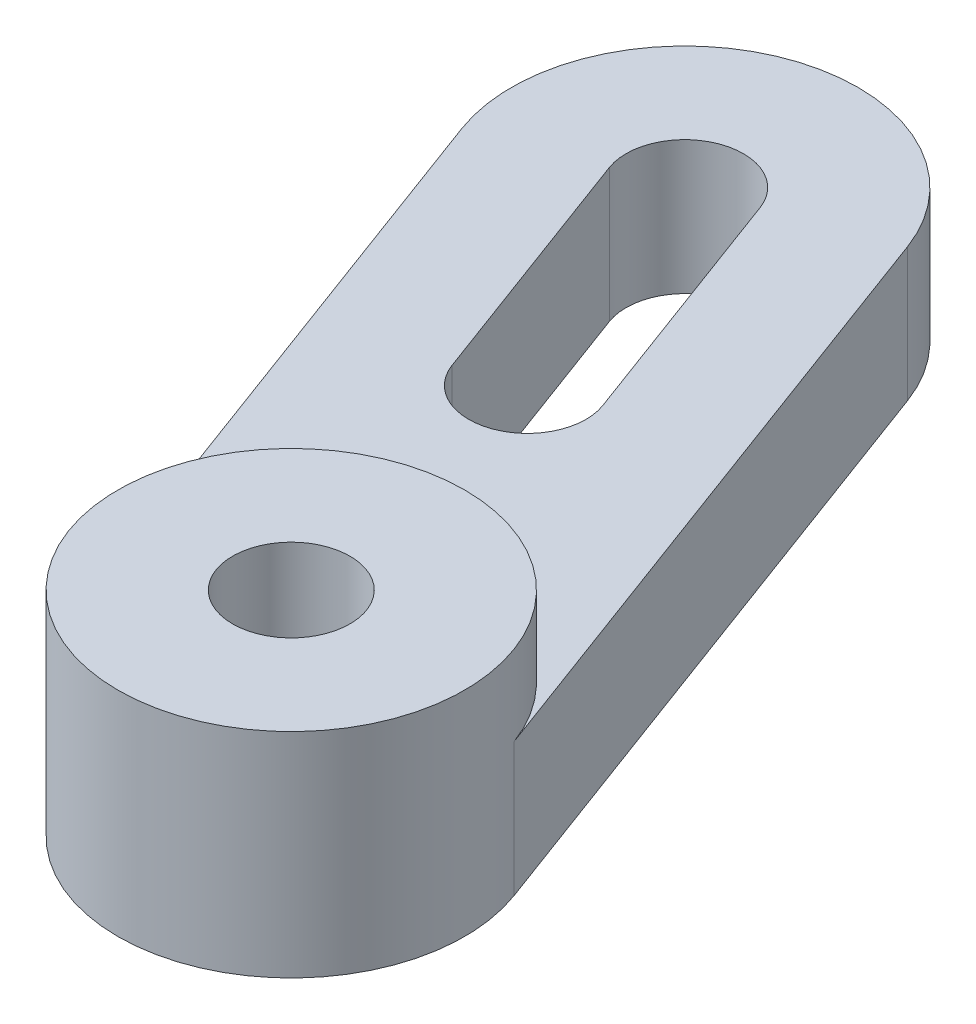
ISO-10303-21;
HEADER;
FILE_DESCRIPTION(('STEP AP214'),'2;1');
FILE_NAME('part.step','',(''),(''),'','','');
FILE_SCHEMA(('AUTOMOTIVE_DESIGN { 1 0 10303 214 1 1 1 1 }'));
ENDSEC;
DATA;
#1=APPLICATION_CONTEXT('core data for automotive mechanical design processes');
#2=APPLICATION_PROTOCOL_DEFINITION('international standard','automotive_design',2000,#1);
#3=PRODUCT_CONTEXT('',#1,'mechanical');
#4=PRODUCT('Part','Part','',(#3));
#5=PRODUCT_RELATED_PRODUCT_CATEGORY('part','',(#4));
#6=PRODUCT_DEFINITION_FORMATION('','',#4);
#7=PRODUCT_DEFINITION_CONTEXT('part definition',#1,'design');
#8=PRODUCT_DEFINITION('design','',#6,#7);
#9=PRODUCT_DEFINITION_SHAPE('','',#8);
#10=(LENGTH_UNIT() NAMED_UNIT(*) SI_UNIT(.MILLI.,.METRE.));
#11=(NAMED_UNIT(*) PLANE_ANGLE_UNIT() SI_UNIT($,.RADIAN.));
#12=(NAMED_UNIT(*) SI_UNIT($,.STERADIAN.) SOLID_ANGLE_UNIT());
#13=UNCERTAINTY_MEASURE_WITH_UNIT(LENGTH_MEASURE(1.E-05),#10,'distance_accuracy_value','');
#14=(GEOMETRIC_REPRESENTATION_CONTEXT(3) GLOBAL_UNCERTAINTY_ASSIGNED_CONTEXT((#13)) GLOBAL_UNIT_ASSIGNED_CONTEXT((#10,
#11,#12)) REPRESENTATION_CONTEXT('',''));
#15=CARTESIAN_POINT('',(0.,0.,0.));
#16=DIRECTION('',(0.,0.,1.));
#17=DIRECTION('',(1.,0.,0.));
#18=AXIS2_PLACEMENT_3D('',#15,#16,#17);
#19=CARTESIAN_POINT('',(-7.06371434958626,5.,-0.409749374924753));
#20=DIRECTION('',(0.,1.,0.));
#21=DIRECTION('',(0.,0.,1.));
#22=AXIS2_PLACEMENT_3D('',#19,#20,#21);
#23=PLANE('',#22);
#24=CARTESIAN_POINT('',(-7.06371434958626,5.,-0.409749374924753));
#25=DIRECTION('',(0.,1.,0.));
#26=DIRECTION('',(0.,0.,1.));
#27=AXIS2_PLACEMENT_3D('',#24,#25,#26);
#28=CIRCLE('',#27,6.5);
#29=CARTESIAN_POINT('',(-0.969220118582904,5.,-2.66964761782571));
#30=VERTEX_POINT('',#29);
#31=CARTESIAN_POINT('',(-13.1582085805896,5.,1.8501488679762));
#32=VERTEX_POINT('',#31);
#33=EDGE_CURVE('E105',#30,#32,#28,.T.);
#34=ORIENTED_EDGE('',*,*,#33,.F.);
#35=DIRECTION('',(-0.347676652753994,0.,-0.937614497077439));
#36=VECTOR('',#35,1.);
#37=CARTESIAN_POINT('',(-0.969220118582911,5.,-2.66964761782571));
#38=LINE('',#37,#36);
#39=CARTESIAN_POINT('',(-9.66113643743275,5.,-26.1100100447617));
#40=VERTEX_POINT('',#39);
#41=EDGE_CURVE('E110',#30,#40,#38,.T.);
#42=ORIENTED_EDGE('',*,*,#41,.T.);
#43=CARTESIAN_POINT('',(-15.7556306684361,5.,-23.8501118018607));
#44=DIRECTION('',(0.,1.,0.));
#45=DIRECTION('',(0.,0.,1.));
#46=AXIS2_PLACEMENT_3D('',#43,#44,#45);
#47=CIRCLE('',#46,6.5);
#48=CARTESIAN_POINT('',(-21.8501248994395,5.,-21.5902135589598));
#49=VERTEX_POINT('',#48);
#50=EDGE_CURVE('E115',#40,#49,#47,.T.);
#51=ORIENTED_EDGE('',*,*,#50,.T.);
#52=DIRECTION('',(0.347676652753994,0.,0.937614497077439));
#53=VECTOR('',#52,1.);
#54=CARTESIAN_POINT('',(-13.1582085805896,5.,1.8501488679762));
#55=LINE('',#54,#53);
#56=EDGE_CURVE('E120',#49,#32,#55,.T.);
#57=ORIENTED_EDGE('',*,*,#56,.T.);
#58=EDGE_LOOP('',(#34,#42,#51,#57));
#59=FACE_BOUND('',#58,.T.);
#60=DIRECTION('',(0.347676652753994,0.,0.937614497077439));
#61=VECTOR('',#60,1.);
#62=CARTESIAN_POINT('',(-17.8183825620065,5.,-23.0852231658019));
#63=LINE('',#62,#61);
#64=CARTESIAN_POINT('',(-17.8183825620065,5.,-23.0852231658019));
#65=VERTEX_POINT('',#64);
#66=CARTESIAN_POINT('',(-14.3416160344665,5.,-13.7090781950276));
#67=VERTEX_POINT('',#66);
#68=EDGE_CURVE('E179',#65,#67,#63,.T.);
#69=ORIENTED_EDGE('',*,*,#68,.F.);
#70=CARTESIAN_POINT('',(-15.7556306684361,5.,-23.8501118018607));
#71=DIRECTION('',(0.,1.,0.));
#72=DIRECTION('',(0.,0.,1.));
#73=AXIS2_PLACEMENT_3D('',#70,#71,#72);
#74=CIRCLE('',#73,2.2);
#75=CARTESIAN_POINT('',(-13.6928787748657,5.,-24.6150004379195));
#76=VERTEX_POINT('',#75);
#77=EDGE_CURVE('E168',#76,#65,#74,.T.);
#78=ORIENTED_EDGE('',*,*,#77,.F.);
#79=DIRECTION('',(-0.347676652753994,0.,-0.937614497077439));
#80=VECTOR('',#79,1.);
#81=CARTESIAN_POINT('',(-13.6928787748657,5.,-24.6150004379195));
#82=LINE('',#81,#80);
#83=CARTESIAN_POINT('',(-10.2161122473258,5.,-15.2388554671451));
#84=VERTEX_POINT('',#83);
#85=EDGE_CURVE('E164',#84,#76,#82,.T.);
#86=ORIENTED_EDGE('',*,*,#85,.F.);
#87=CARTESIAN_POINT('',(-12.2788641408962,5.,-14.4739668310863));
#88=DIRECTION('',(0.,1.,0.));
#89=DIRECTION('',(0.,0.,1.));
#90=AXIS2_PLACEMENT_3D('',#87,#88,#89);
#91=CIRCLE('',#90,2.2);
#92=EDGE_CURVE('E177',#67,#84,#91,.T.);
#93=ORIENTED_EDGE('',*,*,#92,.F.);
#94=EDGE_LOOP('',(#69,#78,#86,#93));
#95=FACE_BOUND('',#94,.T.);
#96=ADVANCED_FACE('F32',(#59,#95),#23,.T.);
#97=CARTESIAN_POINT('',(-7.06371434958626,0.,-0.409749374924753));
#98=DIRECTION('',(0.,1.,0.));
#99=DIRECTION('',(0.,0.,1.));
#100=AXIS2_PLACEMENT_3D('',#97,#98,#99);
#101=PLANE('',#100);
#102=CARTESIAN_POINT('',(-15.7556306684361,0.,-23.8501118018607));
#103=DIRECTION('',(0.,1.,0.));
#104=DIRECTION('',(0.,0.,1.));
#105=AXIS2_PLACEMENT_3D('',#102,#103,#104);
#106=CIRCLE('',#105,2.2);
#107=CARTESIAN_POINT('',(-13.6928787748657,0.,-24.6150004379195));
#108=VERTEX_POINT('',#107);
#109=CARTESIAN_POINT('',(-17.8183825620065,0.,-23.0852231658019));
#110=VERTEX_POINT('',#109);
#111=EDGE_CURVE('E57',#108,#110,#106,.T.);
#112=ORIENTED_EDGE('',*,*,#111,.T.);
#113=DIRECTION('',(0.347676652753994,0.,0.937614497077439));
#114=VECTOR('',#113,1.);
#115=CARTESIAN_POINT('',(-17.8183825620065,0.,-23.0852231658019));
#116=LINE('',#115,#114);
#117=CARTESIAN_POINT('',(-14.3416160344665,0.,-13.7090781950276));
#118=VERTEX_POINT('',#117);
#119=EDGE_CURVE('E172',#110,#118,#116,.T.);
#120=ORIENTED_EDGE('',*,*,#119,.T.);
#121=CARTESIAN_POINT('',(-12.2788641408962,0.,-14.4739668310863));
#122=DIRECTION('',(0.,1.,0.));
#123=DIRECTION('',(0.,0.,1.));
#124=AXIS2_PLACEMENT_3D('',#121,#122,#123);
#125=CIRCLE('',#124,2.2);
#126=CARTESIAN_POINT('',(-10.2161122473258,0.,-15.2388554671451));
#127=VERTEX_POINT('',#126);
#128=EDGE_CURVE('E169',#118,#127,#125,.T.);
#129=ORIENTED_EDGE('',*,*,#128,.T.);
#130=DIRECTION('',(-0.347676652753994,0.,-0.937614497077439));
#131=VECTOR('',#130,1.);
#132=CARTESIAN_POINT('',(-13.6928787748657,0.,-24.6150004379195));
#133=LINE('',#132,#131);
#134=EDGE_CURVE('E165',#127,#108,#133,.T.);
#135=ORIENTED_EDGE('',*,*,#134,.T.);
#136=EDGE_LOOP('',(#112,#120,#129,#135));
#137=FACE_BOUND('',#136,.T.);
#138=CARTESIAN_POINT('',(-7.06371434958626,0.,-0.409749374924753));
#139=DIRECTION('',(0.,1.,0.));
#140=DIRECTION('',(0.,0.,1.));
#141=AXIS2_PLACEMENT_3D('',#138,#139,#140);
#142=CIRCLE('',#141,6.49999999999999);
#143=CARTESIAN_POINT('',(-13.1582085805896,0.,1.8501488679762));
#144=VERTEX_POINT('',#143);
#145=CARTESIAN_POINT('',(-0.969220118582911,0.,-2.66964761782571));
#146=VERTEX_POINT('',#145);
#147=EDGE_CURVE('E107',#144,#146,#142,.T.);
#148=ORIENTED_EDGE('',*,*,#147,.F.);
#149=DIRECTION('',(0.347676652753994,0.,0.937614497077439));
#150=VECTOR('',#149,1.);
#151=CARTESIAN_POINT('',(-13.1582085805896,0.,1.8501488679762));
#152=LINE('',#151,#150);
#153=CARTESIAN_POINT('',(-21.8501248994395,0.,-21.5902135589598));
#154=VERTEX_POINT('',#153);
#155=EDGE_CURVE('E116',#154,#144,#152,.T.);
#156=ORIENTED_EDGE('',*,*,#155,.F.);
#157=CARTESIAN_POINT('',(-15.7556306684361,0.,-23.8501118018607));
#158=DIRECTION('',(0.,1.,0.));
#159=DIRECTION('',(0.,0.,1.));
#160=AXIS2_PLACEMENT_3D('',#157,#158,#159);
#161=CIRCLE('',#160,6.5);
#162=CARTESIAN_POINT('',(-9.66113643743275,0.,-26.1100100447617));
#163=VERTEX_POINT('',#162);
#164=EDGE_CURVE('E151',#163,#154,#161,.T.);
#165=ORIENTED_EDGE('',*,*,#164,.F.);
#166=DIRECTION('',(-0.347676652753994,0.,-0.937614497077439));
#167=VECTOR('',#166,1.);
#168=CARTESIAN_POINT('',(-0.969220118582911,0.,-2.66964761782571));
#169=LINE('',#168,#167);
#170=EDGE_CURVE('E153',#146,#163,#169,.T.);
#171=ORIENTED_EDGE('',*,*,#170,.F.);
#172=EDGE_LOOP('',(#148,#156,#165,#171));
#173=FACE_BOUND('',#172,.T.);
#174=CARTESIAN_POINT('',(-7.06371434958626,0.,-0.409749374924753));
#175=DIRECTION('',(0.,1.,0.));
#176=DIRECTION('',(0.,0.,1.));
#177=AXIS2_PLACEMENT_3D('',#174,#175,#176);
#178=CIRCLE('',#177,2.2);
#179=CARTESIAN_POINT('',(-7.06371434958626,0.,1.79025062507525));
#180=VERTEX_POINT('',#179);
#181=EDGE_CURVE('E126',#180,#180,#178,.T.);
#182=ORIENTED_EDGE('',*,*,#181,.T.);
#183=EDGE_LOOP('',(#182));
#184=FACE_BOUND('',#183,.T.);
#185=ADVANCED_FACE('F193',(#137,#173,#184),#101,.F.);
#186=CARTESIAN_POINT('',(-7.06371434958626,5.,-0.409749374924753));
#187=DIRECTION('',(0.,-1.,0.));
#188=DIRECTION('',(0.,0.,-1.));
#189=AXIS2_PLACEMENT_3D('',#186,#187,#188);
#190=CYLINDRICAL_SURFACE('',#189,6.49999999999999);
#191=ORIENTED_EDGE('',*,*,#147,.T.);
#192=DIRECTION('',(0.,-1.,0.));
#193=VECTOR('',#192,1.);
#194=CARTESIAN_POINT('',(-0.969220118582911,5.,-2.66964761782571));
#195=LINE('',#194,#193);
#196=EDGE_CURVE('E11',#30,#146,#195,.T.);
#197=ORIENTED_EDGE('',*,*,#196,.F.);
#198=ORIENTED_EDGE('',*,*,#33,.T.);
#199=DIRECTION('',(0.,-1.,0.));
#200=VECTOR('',#199,1.);
#201=CARTESIAN_POINT('',(-13.1582085805896,5.,1.8501488679762));
#202=LINE('',#201,#200);
#203=EDGE_CURVE('E142',#32,#144,#202,.T.);
#204=ORIENTED_EDGE('',*,*,#203,.T.);
#205=EDGE_LOOP('',(#191,#197,#198,#204));
#206=FACE_BOUND('',#205,.T.);
#207=CARTESIAN_POINT('',(-7.06371434958626,8.,-0.409749374924753));
#208=DIRECTION('',(0.,1.,0.));
#209=DIRECTION('',(0.,0.,1.));
#210=AXIS2_PLACEMENT_3D('',#207,#208,#209);
#211=CIRCLE('',#210,6.5);
#212=CARTESIAN_POINT('',(-7.06371434958626,8.,6.09025062507525));
#213=VERTEX_POINT('',#212);
#214=EDGE_CURVE('E122',#213,#213,#211,.T.);
#215=ORIENTED_EDGE('',*,*,#214,.F.);
#216=EDGE_LOOP('',(#215));
#217=FACE_BOUND('',#216,.T.);
#218=ADVANCED_FACE('F34',(#206,#217),#190,.T.);
#219=CARTESIAN_POINT('',(-0.969220118582911,5.,-2.66964761782571));
#220=DIRECTION('',(-0.937614497077439,0.,0.347676652753994));
#221=DIRECTION('',(0.347676652753994,0.,0.937614497077439));
#222=AXIS2_PLACEMENT_3D('',#219,#220,#221);
#223=PLANE('',#222);
#224=ORIENTED_EDGE('',*,*,#170,.T.);
#225=DIRECTION('',(0.,-1.,0.));
#226=VECTOR('',#225,1.);
#227=CARTESIAN_POINT('',(-9.66113643743275,5.,-26.1100100447617));
#228=LINE('',#227,#226);
#229=EDGE_CURVE('E41',#40,#163,#228,.T.);
#230=ORIENTED_EDGE('',*,*,#229,.F.);
#231=ORIENTED_EDGE('',*,*,#41,.F.);
#232=ORIENTED_EDGE('',*,*,#196,.T.);
#233=EDGE_LOOP('',(#224,#230,#231,#232));
#234=FACE_BOUND('',#233,.T.);
#235=ADVANCED_FACE('F111',(#234),#223,.F.);
#236=CARTESIAN_POINT('',(-15.7556306684361,5.,-23.8501118018607));
#237=DIRECTION('',(0.,-1.,0.));
#238=DIRECTION('',(0.,0.,-1.));
#239=AXIS2_PLACEMENT_3D('',#236,#237,#238);
#240=CYLINDRICAL_SURFACE('',#239,6.5);
#241=ORIENTED_EDGE('',*,*,#164,.T.);
#242=DIRECTION('',(0.,-1.,0.));
#243=VECTOR('',#242,1.);
#244=CARTESIAN_POINT('',(-21.8501248994395,5.,-21.5902135589598));
#245=LINE('',#244,#243);
#246=EDGE_CURVE('E144',#49,#154,#245,.T.);
#247=ORIENTED_EDGE('',*,*,#246,.F.);
#248=ORIENTED_EDGE('',*,*,#50,.F.);
#249=ORIENTED_EDGE('',*,*,#229,.T.);
#250=EDGE_LOOP('',(#241,#247,#248,#249));
#251=FACE_BOUND('',#250,.T.);
#252=ADVANCED_FACE('F219',(#251),#240,.T.);
#253=CARTESIAN_POINT('',(-13.1582085805896,5.,1.8501488679762));
#254=DIRECTION('',(0.937614497077439,0.,-0.347676652753994));
#255=DIRECTION('',(-0.347676652753994,0.,-0.937614497077439));
#256=AXIS2_PLACEMENT_3D('',#253,#254,#255);
#257=PLANE('',#256);
#258=ORIENTED_EDGE('',*,*,#155,.T.);
#259=ORIENTED_EDGE('',*,*,#203,.F.);
#260=ORIENTED_EDGE('',*,*,#56,.F.);
#261=ORIENTED_EDGE('',*,*,#246,.T.);
#262=EDGE_LOOP('',(#258,#259,#260,#261));
#263=FACE_BOUND('',#262,.T.);
#264=ADVANCED_FACE('F216',(#263),#257,.F.);
#265=CARTESIAN_POINT('',(-15.7556306684361,5.,-23.8501118018607));
#266=DIRECTION('',(0.,-1.,0.));
#267=DIRECTION('',(0.,0.,-1.));
#268=AXIS2_PLACEMENT_3D('',#265,#266,#267);
#269=CYLINDRICAL_SURFACE('',#268,2.2);
#270=ORIENTED_EDGE('',*,*,#111,.F.);
#271=DIRECTION('',(0.,-1.,0.));
#272=VECTOR('',#271,1.);
#273=CARTESIAN_POINT('',(-13.6928787748657,5.,-24.6150004379195));
#274=LINE('',#273,#272);
#275=EDGE_CURVE('E162',#76,#108,#274,.T.);
#276=ORIENTED_EDGE('',*,*,#275,.F.);
#277=ORIENTED_EDGE('',*,*,#77,.T.);
#278=DIRECTION('',(0.,-1.,0.));
#279=VECTOR('',#278,1.);
#280=CARTESIAN_POINT('',(-17.8183825620065,5.,-23.0852231658019));
#281=LINE('',#280,#279);
#282=EDGE_CURVE('E156',#65,#110,#281,.T.);
#283=ORIENTED_EDGE('',*,*,#282,.T.);
#284=EDGE_LOOP('',(#270,#276,#277,#283));
#285=FACE_BOUND('',#284,.T.);
#286=ADVANCED_FACE('F182',(#285),#269,.F.);
#287=CARTESIAN_POINT('',(-17.8183825620065,5.,-23.0852231658019));
#288=DIRECTION('',(0.937614497077439,0.,-0.347676652753994));
#289=DIRECTION('',(-0.347676652753994,0.,-0.937614497077439));
#290=AXIS2_PLACEMENT_3D('',#287,#288,#289);
#291=PLANE('',#290);
#292=ORIENTED_EDGE('',*,*,#119,.F.);
#293=ORIENTED_EDGE('',*,*,#282,.F.);
#294=ORIENTED_EDGE('',*,*,#68,.T.);
#295=DIRECTION('',(0.,-1.,0.));
#296=VECTOR('',#295,1.);
#297=CARTESIAN_POINT('',(-14.3416160344665,5.,-13.7090781950276));
#298=LINE('',#297,#296);
#299=EDGE_CURVE('E159',#67,#118,#298,.T.);
#300=ORIENTED_EDGE('',*,*,#299,.T.);
#301=EDGE_LOOP('',(#292,#293,#294,#300));
#302=FACE_BOUND('',#301,.T.);
#303=ADVANCED_FACE('F186',(#302),#291,.T.);
#304=CARTESIAN_POINT('',(-12.2788641408962,5.,-14.4739668310863));
#305=DIRECTION('',(0.,-1.,0.));
#306=DIRECTION('',(0.,0.,-1.));
#307=AXIS2_PLACEMENT_3D('',#304,#305,#306);
#308=CYLINDRICAL_SURFACE('',#307,2.2);
#309=ORIENTED_EDGE('',*,*,#128,.F.);
#310=ORIENTED_EDGE('',*,*,#299,.F.);
#311=ORIENTED_EDGE('',*,*,#92,.T.);
#312=DIRECTION('',(0.,-1.,0.));
#313=VECTOR('',#312,1.);
#314=CARTESIAN_POINT('',(-10.2161122473258,5.,-15.2388554671451));
#315=LINE('',#314,#313);
#316=EDGE_CURVE('E49',#84,#127,#315,.T.);
#317=ORIENTED_EDGE('',*,*,#316,.T.);
#318=EDGE_LOOP('',(#309,#310,#311,#317));
#319=FACE_BOUND('',#318,.T.);
#320=ADVANCED_FACE('F191',(#319),#308,.F.);
#321=CARTESIAN_POINT('',(-13.6928787748657,5.,-24.6150004379195));
#322=DIRECTION('',(-0.937614497077439,0.,0.347676652753994));
#323=DIRECTION('',(0.347676652753994,0.,0.937614497077439));
#324=AXIS2_PLACEMENT_3D('',#321,#322,#323);
#325=PLANE('',#324);
#326=ORIENTED_EDGE('',*,*,#134,.F.);
#327=ORIENTED_EDGE('',*,*,#316,.F.);
#328=ORIENTED_EDGE('',*,*,#85,.T.);
#329=ORIENTED_EDGE('',*,*,#275,.T.);
#330=EDGE_LOOP('',(#326,#327,#328,#329));
#331=FACE_BOUND('',#330,.T.);
#332=ADVANCED_FACE('F195',(#331),#325,.T.);
#333=CARTESIAN_POINT('',(-7.06371434958626,5.,-0.409749374924753));
#334=DIRECTION('',(0.,-1.,0.));
#335=DIRECTION('',(0.,0.,-1.));
#336=AXIS2_PLACEMENT_3D('',#333,#334,#335);
#337=CYLINDRICAL_SURFACE('',#336,2.2);
#338=ORIENTED_EDGE('',*,*,#181,.F.);
#339=EDGE_LOOP('',(#338));
#340=FACE_BOUND('',#339,.T.);
#341=CARTESIAN_POINT('',(-7.06371434958626,8.,-0.409749374924753));
#342=DIRECTION('',(0.,1.,0.));
#343=DIRECTION('',(0.,0.,1.));
#344=AXIS2_PLACEMENT_3D('',#341,#342,#343);
#345=CIRCLE('',#344,2.2);
#346=CARTESIAN_POINT('',(-7.06371434958626,8.,1.79025062507525));
#347=VERTEX_POINT('',#346);
#348=EDGE_CURVE('E123',#347,#347,#345,.T.);
#349=ORIENTED_EDGE('',*,*,#348,.T.);
#350=EDGE_LOOP('',(#349));
#351=FACE_BOUND('',#350,.T.);
#352=ADVANCED_FACE('F197',(#340,#351),#337,.F.);
#353=CARTESIAN_POINT('',(-7.06371434958626,8.,-0.409749374924753));
#354=DIRECTION('',(0.,1.,0.));
#355=DIRECTION('',(0.,0.,1.));
#356=AXIS2_PLACEMENT_3D('',#353,#354,#355);
#357=PLANE('',#356);
#358=ORIENTED_EDGE('',*,*,#214,.T.);
#359=EDGE_LOOP('',(#358));
#360=FACE_BOUND('',#359,.T.);
#361=ORIENTED_EDGE('',*,*,#348,.F.);
#362=EDGE_LOOP('',(#361));
#363=FACE_BOUND('',#362,.T.);
#364=ADVANCED_FACE('F203',(#360,#363),#357,.T.);
#365=CLOSED_SHELL('',(#96,#185,#218,#235,#252,#264,#286,#303,#320,#332,#352,#364));
#366=MANIFOLD_SOLID_BREP('B2',#365);
#367=ADVANCED_BREP_SHAPE_REPRESENTATION('',(#18,#366),#14);
#368=SHAPE_DEFINITION_REPRESENTATION(#9,#367);
ENDSEC;
END-ISO-10303-21;
